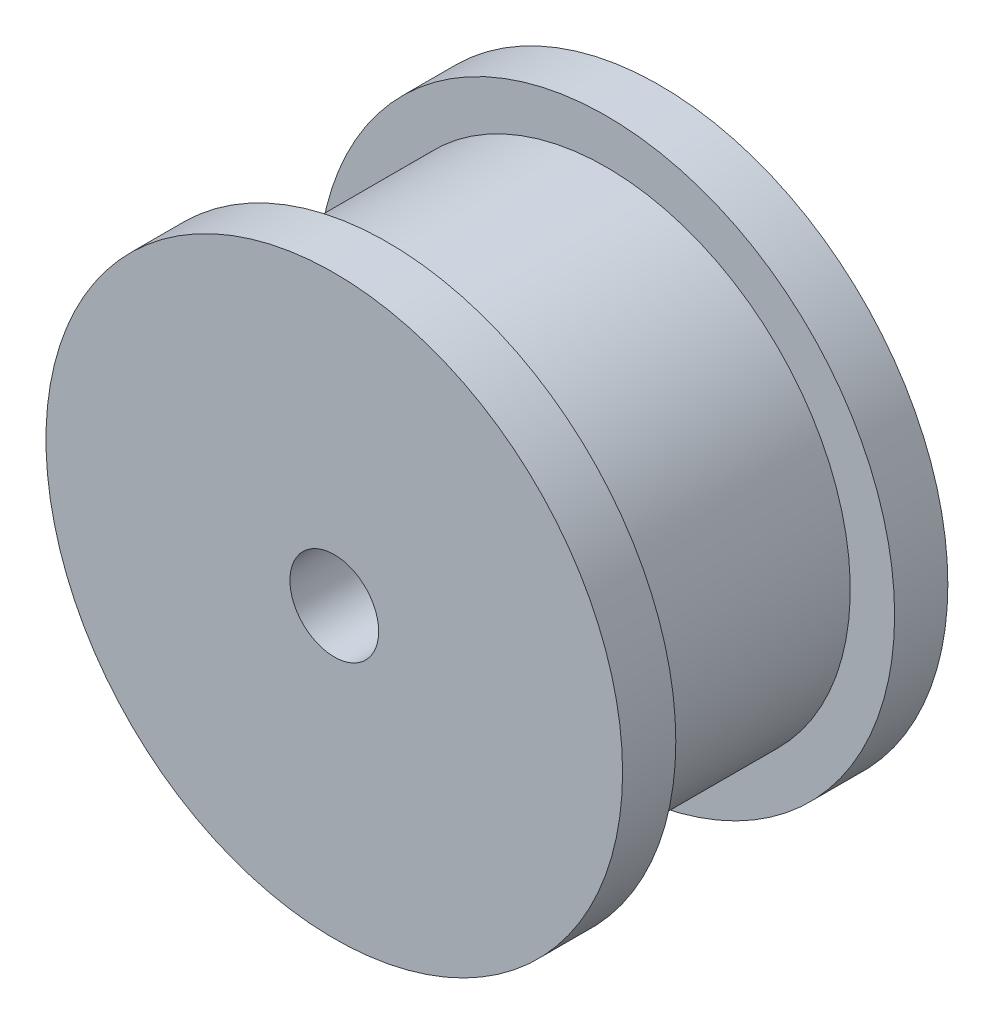
ISO-10303-21;
HEADER;
FILE_DESCRIPTION(('STEP AP214'),'2;1');
FILE_NAME('part.step','',(''),(''),'','','');
FILE_SCHEMA(('AUTOMOTIVE_DESIGN { 1 0 10303 214 1 1 1 1 }'));
ENDSEC;
DATA;
#1=APPLICATION_CONTEXT('core data for automotive mechanical design processes');
#2=APPLICATION_PROTOCOL_DEFINITION('international standard','automotive_design',2000,#1);
#3=PRODUCT_CONTEXT('',#1,'mechanical');
#4=PRODUCT('Part','Part','',(#3));
#5=PRODUCT_RELATED_PRODUCT_CATEGORY('part','',(#4));
#6=PRODUCT_DEFINITION_FORMATION('','',#4);
#7=PRODUCT_DEFINITION_CONTEXT('part definition',#1,'design');
#8=PRODUCT_DEFINITION('design','',#6,#7);
#9=PRODUCT_DEFINITION_SHAPE('','',#8);
#10=(LENGTH_UNIT() NAMED_UNIT(*) SI_UNIT(.MILLI.,.METRE.));
#11=(NAMED_UNIT(*) PLANE_ANGLE_UNIT() SI_UNIT($,.RADIAN.));
#12=(NAMED_UNIT(*) SI_UNIT($,.STERADIAN.) SOLID_ANGLE_UNIT());
#13=UNCERTAINTY_MEASURE_WITH_UNIT(LENGTH_MEASURE(1.E-05),#10,'distance_accuracy_value','');
#14=(GEOMETRIC_REPRESENTATION_CONTEXT(3) GLOBAL_UNCERTAINTY_ASSIGNED_CONTEXT((#13)) GLOBAL_UNIT_ASSIGNED_CONTEXT((#10,
#11,#12)) REPRESENTATION_CONTEXT('',''));
#15=CARTESIAN_POINT('',(0.,0.,0.));
#16=DIRECTION('',(0.,0.,1.));
#17=DIRECTION('',(1.,0.,0.));
#18=AXIS2_PLACEMENT_3D('',#15,#16,#17);
#19=CARTESIAN_POINT('',(0.,0.,7.4));
#20=DIRECTION('',(0.,0.,-1.));
#21=DIRECTION('',(-1.,0.,0.));
#22=AXIS2_PLACEMENT_3D('',#19,#20,#21);
#23=CYLINDRICAL_SURFACE('',#22,16.5);
#24=CARTESIAN_POINT('',(0.,0.,7.4));
#25=DIRECTION('',(0.,0.,1.));
#26=DIRECTION('',(1.,0.,0.));
#27=AXIS2_PLACEMENT_3D('',#24,#25,#26);
#28=CIRCLE('',#27,16.5);
#29=CARTESIAN_POINT('',(16.5,0.,7.4));
#30=VERTEX_POINT('',#29);
#31=EDGE_CURVE('E53',#30,#30,#28,.T.);
#32=ORIENTED_EDGE('',*,*,#31,.F.);
#33=EDGE_LOOP('',(#32));
#34=FACE_BOUND('',#33,.T.);
#35=CARTESIAN_POINT('',(0.,0.,-7.4));
#36=DIRECTION('',(0.,0.,-1.));
#37=DIRECTION('',(-1.,0.,0.));
#38=AXIS2_PLACEMENT_3D('',#35,#36,#37);
#39=CIRCLE('',#38,16.5);
#40=CARTESIAN_POINT('',(-16.5,0.,-7.4));
#41=VERTEX_POINT('',#40);
#42=EDGE_CURVE('E60',#41,#41,#39,.T.);
#43=ORIENTED_EDGE('',*,*,#42,.F.);
#44=EDGE_LOOP('',(#43));
#45=FACE_BOUND('',#44,.T.);
#46=ADVANCED_FACE('F33',(#34,#45),#23,.T.);
#47=CARTESIAN_POINT('',(0.,0.,7.4));
#48=DIRECTION('',(0.,0.,1.));
#49=DIRECTION('',(1.,0.,0.));
#50=AXIS2_PLACEMENT_3D('',#47,#48,#49);
#51=PLANE('',#50);
#52=CARTESIAN_POINT('',(0.,0.,7.4));
#53=DIRECTION('',(0.,0.,1.));
#54=DIRECTION('',(1.,0.,0.));
#55=AXIS2_PLACEMENT_3D('',#52,#53,#54);
#56=CIRCLE('',#55,19.5);
#57=CARTESIAN_POINT('',(19.5,0.,7.4));
#58=VERTEX_POINT('',#57);
#59=EDGE_CURVE('E57',#58,#58,#56,.T.);
#60=ORIENTED_EDGE('',*,*,#59,.F.);
#61=EDGE_LOOP('',(#60));
#62=FACE_BOUND('',#61,.T.);
#63=ORIENTED_EDGE('',*,*,#31,.T.);
#64=EDGE_LOOP('',(#63));
#65=FACE_BOUND('',#64,.T.);
#66=ADVANCED_FACE('F99',(#62,#65),#51,.F.);
#67=CARTESIAN_POINT('',(0.,0.,11.));
#68=DIRECTION('',(0.,0.,1.));
#69=DIRECTION('',(1.,0.,0.));
#70=AXIS2_PLACEMENT_3D('',#67,#68,#69);
#71=PLANE('',#70);
#72=CARTESIAN_POINT('',(0.,0.,11.));
#73=DIRECTION('',(0.,0.,1.));
#74=DIRECTION('',(1.,0.,0.));
#75=AXIS2_PLACEMENT_3D('',#72,#73,#74);
#76=CIRCLE('',#75,3.);
#77=CARTESIAN_POINT('',(3.,0.,11.));
#78=VERTEX_POINT('',#77);
#79=EDGE_CURVE('E71',#78,#78,#76,.T.);
#80=ORIENTED_EDGE('',*,*,#79,.F.);
#81=EDGE_LOOP('',(#80));
#82=FACE_BOUND('',#81,.T.);
#83=CARTESIAN_POINT('',(0.,0.,11.));
#84=DIRECTION('',(0.,0.,1.));
#85=DIRECTION('',(1.,0.,0.));
#86=AXIS2_PLACEMENT_3D('',#83,#84,#85);
#87=CIRCLE('',#86,19.5);
#88=CARTESIAN_POINT('',(19.5,0.,11.));
#89=VERTEX_POINT('',#88);
#90=EDGE_CURVE('E56',#89,#89,#87,.T.);
#91=ORIENTED_EDGE('',*,*,#90,.T.);
#92=EDGE_LOOP('',(#91));
#93=FACE_BOUND('',#92,.T.);
#94=ADVANCED_FACE('F105',(#82,#93),#71,.T.);
#95=CARTESIAN_POINT('',(0.,0.,11.));
#96=DIRECTION('',(0.,0.,-1.));
#97=DIRECTION('',(-1.,0.,0.));
#98=AXIS2_PLACEMENT_3D('',#95,#96,#97);
#99=CYLINDRICAL_SURFACE('',#98,19.5);
#100=ORIENTED_EDGE('',*,*,#90,.F.);
#101=EDGE_LOOP('',(#100));
#102=FACE_BOUND('',#101,.T.);
#103=ORIENTED_EDGE('',*,*,#59,.T.);
#104=EDGE_LOOP('',(#103));
#105=FACE_BOUND('',#104,.T.);
#106=ADVANCED_FACE('F111',(#102,#105),#99,.T.);
#107=CARTESIAN_POINT('',(0.,0.,-7.4));
#108=DIRECTION('',(0.,0.,-1.));
#109=DIRECTION('',(1.,0.,0.));
#110=AXIS2_PLACEMENT_3D('',#107,#108,#109);
#111=PLANE('',#110);
#112=CARTESIAN_POINT('',(0.,0.,-7.4));
#113=DIRECTION('',(0.,0.,1.));
#114=DIRECTION('',(1.,0.,0.));
#115=AXIS2_PLACEMENT_3D('',#112,#113,#114);
#116=CIRCLE('',#115,19.5);
#117=CARTESIAN_POINT('',(19.5,0.,-7.4));
#118=VERTEX_POINT('',#117);
#119=EDGE_CURVE('E66',#118,#118,#116,.T.);
#120=ORIENTED_EDGE('',*,*,#119,.T.);
#121=EDGE_LOOP('',(#120));
#122=FACE_BOUND('',#121,.T.);
#123=ORIENTED_EDGE('',*,*,#42,.T.);
#124=EDGE_LOOP('',(#123));
#125=FACE_BOUND('',#124,.T.);
#126=ADVANCED_FACE('F126',(#122,#125),#111,.F.);
#127=CARTESIAN_POINT('',(0.,0.,-11.));
#128=DIRECTION('',(0.,0.,1.));
#129=DIRECTION('',(1.,0.,0.));
#130=AXIS2_PLACEMENT_3D('',#127,#128,#129);
#131=CYLINDRICAL_SURFACE('',#130,19.5);
#132=CARTESIAN_POINT('',(0.,0.,-11.));
#133=DIRECTION('',(0.,0.,1.));
#134=DIRECTION('',(1.,0.,0.));
#135=AXIS2_PLACEMENT_3D('',#132,#133,#134);
#136=CIRCLE('',#135,19.5);
#137=CARTESIAN_POINT('',(19.5,0.,-11.));
#138=VERTEX_POINT('',#137);
#139=EDGE_CURVE('E65',#138,#138,#136,.T.);
#140=ORIENTED_EDGE('',*,*,#139,.T.);
#141=EDGE_LOOP('',(#140));
#142=FACE_BOUND('',#141,.T.);
#143=ORIENTED_EDGE('',*,*,#119,.F.);
#144=EDGE_LOOP('',(#143));
#145=FACE_BOUND('',#144,.T.);
#146=ADVANCED_FACE('F94',(#142,#145),#131,.T.);
#147=CARTESIAN_POINT('',(0.,0.,-11.));
#148=DIRECTION('',(0.,0.,-1.));
#149=DIRECTION('',(1.,0.,0.));
#150=AXIS2_PLACEMENT_3D('',#147,#148,#149);
#151=PLANE('',#150);
#152=CARTESIAN_POINT('',(0.,0.,-11.));
#153=DIRECTION('',(0.,0.,-1.));
#154=DIRECTION('',(-1.,0.,0.));
#155=AXIS2_PLACEMENT_3D('',#152,#153,#154);
#156=CIRCLE('',#155,13.3284271247462);
#157=CARTESIAN_POINT('',(-13.3284271247462,0.,-11.));
#158=VERTEX_POINT('',#157);
#159=EDGE_CURVE('E50',#158,#158,#156,.F.);
#160=ORIENTED_EDGE('',*,*,#159,.T.);
#161=EDGE_LOOP('',(#160));
#162=FACE_BOUND('',#161,.T.);
#163=ORIENTED_EDGE('',*,*,#139,.F.);
#164=EDGE_LOOP('',(#163));
#165=FACE_BOUND('',#164,.T.);
#166=ADVANCED_FACE('F83',(#162,#165),#151,.T.);
#167=CARTESIAN_POINT('',(0.,0.,-7.4));
#168=DIRECTION('',(0.,0.,-1.));
#169=DIRECTION('',(1.,0.,0.));
#170=AXIS2_PLACEMENT_3D('',#167,#168,#169);
#171=PLANE('',#170);
#172=CARTESIAN_POINT('',(0.,0.,-7.4));
#173=DIRECTION('',(0.,0.,-1.));
#174=DIRECTION('',(-1.,0.,0.));
#175=AXIS2_PLACEMENT_3D('',#172,#173,#174);
#176=CIRCLE('',#175,3.);
#177=CARTESIAN_POINT('',(-3.,0.,-7.4));
#178=VERTEX_POINT('',#177);
#179=EDGE_CURVE('E37',#178,#178,#176,.T.);
#180=ORIENTED_EDGE('',*,*,#179,.F.);
#181=EDGE_LOOP('',(#180));
#182=FACE_BOUND('',#181,.T.);
#183=CARTESIAN_POINT('',(0.,0.,-7.4));
#184=DIRECTION('',(0.,0.,-1.));
#185=DIRECTION('',(-1.,0.,0.));
#186=AXIS2_PLACEMENT_3D('',#183,#184,#185);
#187=CIRCLE('',#186,8.07157287525379);
#188=CARTESIAN_POINT('',(-8.07157287525379,0.,-7.4));
#189=VERTEX_POINT('',#188);
#190=EDGE_CURVE('E10',#189,#189,#187,.T.);
#191=ORIENTED_EDGE('',*,*,#190,.T.);
#192=EDGE_LOOP('',(#191));
#193=FACE_BOUND('',#192,.T.);
#194=ADVANCED_FACE('F80',(#182,#193),#171,.T.);
#195=CARTESIAN_POINT('',(0.,0.,-7.4));
#196=DIRECTION('',(0.,0.,-1.));
#197=DIRECTION('',(-1.,0.,0.));
#198=AXIS2_PLACEMENT_3D('',#195,#196,#197);
#199=CONICAL_SURFACE('',#198,8.89999999999998,0.785398163397453);
#200=CARTESIAN_POINT('',(0.,0.,-10.4142135623731));
#201=DIRECTION('',(0.,0.,-1.));
#202=DIRECTION('',(-1.,0.,0.));
#203=AXIS2_PLACEMENT_3D('',#200,#201,#202);
#204=CIRCLE('',#203,11.9142135623731);
#205=CARTESIAN_POINT('',(-11.9142135623731,0.,-10.4142135623731));
#206=VERTEX_POINT('',#205);
#207=EDGE_CURVE('E41',#206,#206,#204,.T.);
#208=ORIENTED_EDGE('',*,*,#207,.T.);
#209=EDGE_LOOP('',(#208));
#210=FACE_BOUND('',#209,.T.);
#211=CARTESIAN_POINT('',(0.,0.,-7.9857864376269));
#212=DIRECTION('',(0.,0.,1.));
#213=DIRECTION('',(1.,0.,0.));
#214=AXIS2_PLACEMENT_3D('',#211,#212,#213);
#215=CIRCLE('',#214,9.48578643762688);
#216=CARTESIAN_POINT('',(9.48578643762688,0.,-7.9857864376269));
#217=VERTEX_POINT('',#216);
#218=EDGE_CURVE('E45',#217,#217,#215,.T.);
#219=ORIENTED_EDGE('',*,*,#218,.T.);
#220=EDGE_LOOP('',(#219));
#221=FACE_BOUND('',#220,.T.);
#222=ADVANCED_FACE('F82',(#210,#221),#199,.F.);
#223=CARTESIAN_POINT('',(0.,0.,-9.));
#224=DIRECTION('',(0.,0.,-1.));
#225=DIRECTION('',(-1.,0.,0.));
#226=AXIS2_PLACEMENT_3D('',#223,#224,#225);
#227=TOROIDAL_SURFACE('',#226,13.3284271247462,2.);
#228=ORIENTED_EDGE('',*,*,#207,.F.);
#229=EDGE_LOOP('',(#228));
#230=FACE_BOUND('',#229,.T.);
#231=ORIENTED_EDGE('',*,*,#159,.F.);
#232=EDGE_LOOP('',(#231));
#233=FACE_BOUND('',#232,.T.);
#234=ADVANCED_FACE('F90',(#230,#233),#227,.T.);
#235=CARTESIAN_POINT('',(0.,0.,-9.4));
#236=DIRECTION('',(0.,0.,-1.));
#237=DIRECTION('',(-1.,0.,0.));
#238=AXIS2_PLACEMENT_3D('',#235,#236,#237);
#239=TOROIDAL_SURFACE('',#238,8.07157287525379,2.);
#240=ORIENTED_EDGE('',*,*,#218,.F.);
#241=EDGE_LOOP('',(#240));
#242=FACE_BOUND('',#241,.T.);
#243=ORIENTED_EDGE('',*,*,#190,.F.);
#244=EDGE_LOOP('',(#243));
#245=FACE_BOUND('',#244,.T.);
#246=ADVANCED_FACE('F35',(#242,#245),#239,.F.);
#247=CARTESIAN_POINT('',(0.,0.,-11.));
#248=DIRECTION('',(0.,0.,1.));
#249=DIRECTION('',(1.,0.,0.));
#250=AXIS2_PLACEMENT_3D('',#247,#248,#249);
#251=CYLINDRICAL_SURFACE('',#250,3.);
#252=ORIENTED_EDGE('',*,*,#179,.T.);
#253=EDGE_LOOP('',(#252));
#254=FACE_BOUND('',#253,.T.);
#255=ORIENTED_EDGE('',*,*,#79,.T.);
#256=EDGE_LOOP('',(#255));
#257=FACE_BOUND('',#256,.T.);
#258=ADVANCED_FACE('F78',(#254,#257),#251,.F.);
#259=CLOSED_SHELL('',(#46,#66,#94,#106,#126,#146,#166,#194,#222,#234,#246,#258));
#260=MANIFOLD_SOLID_BREP('B2',#259);
#261=ADVANCED_BREP_SHAPE_REPRESENTATION('',(#18,#260),#14);
#262=SHAPE_DEFINITION_REPRESENTATION(#9,#261);
ENDSEC;
END-ISO-10303-21;
